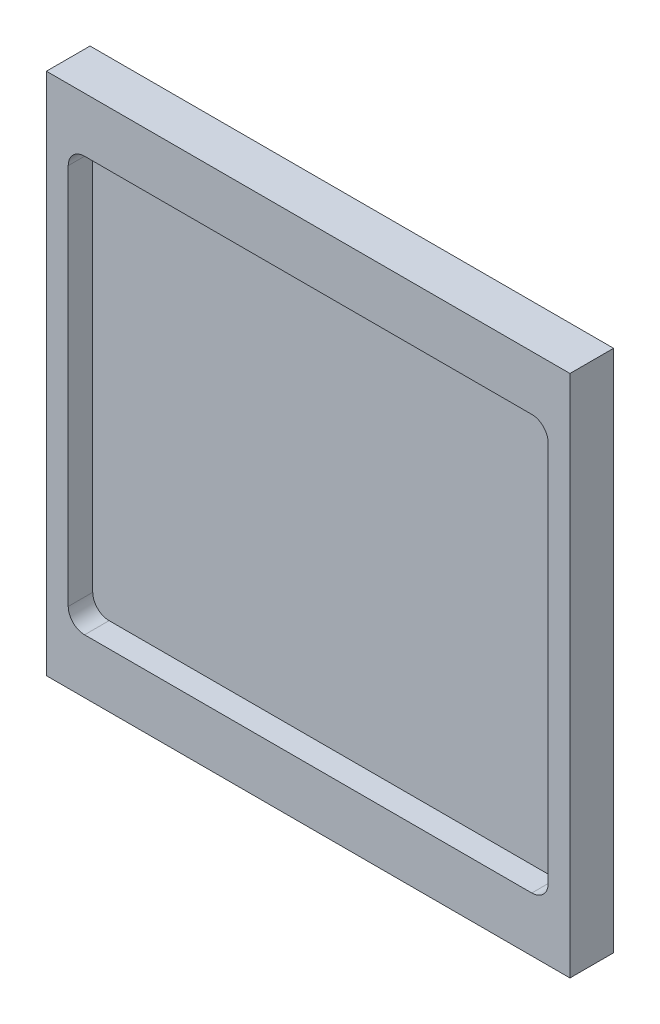
ISO-10303-21;
HEADER;
FILE_DESCRIPTION(('STEP AP214'),'2;1');
FILE_NAME('part.step','',(''),(''),'','','');
FILE_SCHEMA(('AUTOMOTIVE_DESIGN { 1 0 10303 214 1 1 1 1 }'));
ENDSEC;
DATA;
#1=APPLICATION_CONTEXT('core data for automotive mechanical design processes');
#2=APPLICATION_PROTOCOL_DEFINITION('international standard','automotive_design',2000,#1);
#3=PRODUCT_CONTEXT('',#1,'mechanical');
#4=PRODUCT('Part','Part','',(#3));
#5=PRODUCT_RELATED_PRODUCT_CATEGORY('part','',(#4));
#6=PRODUCT_DEFINITION_FORMATION('','',#4);
#7=PRODUCT_DEFINITION_CONTEXT('part definition',#1,'design');
#8=PRODUCT_DEFINITION('design','',#6,#7);
#9=PRODUCT_DEFINITION_SHAPE('','',#8);
#10=(LENGTH_UNIT() NAMED_UNIT(*) SI_UNIT(.MILLI.,.METRE.));
#11=(NAMED_UNIT(*) PLANE_ANGLE_UNIT() SI_UNIT($,.RADIAN.));
#12=(NAMED_UNIT(*) SI_UNIT($,.STERADIAN.) SOLID_ANGLE_UNIT());
#13=UNCERTAINTY_MEASURE_WITH_UNIT(LENGTH_MEASURE(1.E-05),#10,'distance_accuracy_value','');
#14=(GEOMETRIC_REPRESENTATION_CONTEXT(3) GLOBAL_UNCERTAINTY_ASSIGNED_CONTEXT((#13)) GLOBAL_UNIT_ASSIGNED_CONTEXT((#10,
#11,#12)) REPRESENTATION_CONTEXT('',''));
#15=CARTESIAN_POINT('',(0.,0.,0.));
#16=DIRECTION('',(0.,0.,1.));
#17=DIRECTION('',(1.,0.,0.));
#18=AXIS2_PLACEMENT_3D('',#15,#16,#17);
#19=CARTESIAN_POINT('',(76.2,76.2,12.7));
#20=DIRECTION('',(-1.,0.,0.));
#21=DIRECTION('',(0.,0.,1.));
#22=AXIS2_PLACEMENT_3D('',#19,#20,#21);
#23=PLANE('',#22);
#24=DIRECTION('',(0.,1.,0.));
#25=VECTOR('',#24,1.);
#26=CARTESIAN_POINT('',(76.2,76.2,0.));
#27=LINE('',#26,#25);
#28=CARTESIAN_POINT('',(76.2,-76.2,0.));
#29=VERTEX_POINT('',#28);
#30=CARTESIAN_POINT('',(76.2,76.2,0.));
#31=VERTEX_POINT('',#30);
#32=EDGE_CURVE('E189',#29,#31,#27,.T.);
#33=ORIENTED_EDGE('',*,*,#32,.T.);
#34=DIRECTION('',(0.,0.,-1.));
#35=VECTOR('',#34,1.);
#36=CARTESIAN_POINT('',(76.2,76.2,12.7));
#37=LINE('',#36,#35);
#38=CARTESIAN_POINT('',(76.2,76.2,12.7));
#39=VERTEX_POINT('',#38);
#40=EDGE_CURVE('E11',#39,#31,#37,.T.);
#41=ORIENTED_EDGE('',*,*,#40,.F.);
#42=DIRECTION('',(0.,1.,0.));
#43=VECTOR('',#42,1.);
#44=CARTESIAN_POINT('',(76.2,76.2,12.7));
#45=LINE('',#44,#43);
#46=CARTESIAN_POINT('',(76.2,-76.2,12.7));
#47=VERTEX_POINT('',#46);
#48=EDGE_CURVE('E201',#47,#39,#45,.T.);
#49=ORIENTED_EDGE('',*,*,#48,.F.);
#50=DIRECTION('',(0.,0.,-1.));
#51=VECTOR('',#50,1.);
#52=CARTESIAN_POINT('',(76.2,-76.2,12.7));
#53=LINE('',#52,#51);
#54=EDGE_CURVE('E207',#47,#29,#53,.T.);
#55=ORIENTED_EDGE('',*,*,#54,.T.);
#56=EDGE_LOOP('',(#33,#41,#49,#55));
#57=FACE_BOUND('',#56,.T.);
#58=ADVANCED_FACE('F33',(#57),#23,.F.);
#59=CARTESIAN_POINT('',(-76.2,76.2,12.7));
#60=DIRECTION('',(0.,-1.,0.));
#61=DIRECTION('',(0.,0.,-1.));
#62=AXIS2_PLACEMENT_3D('',#59,#60,#61);
#63=PLANE('',#62);
#64=DIRECTION('',(-1.,0.,0.));
#65=VECTOR('',#64,1.);
#66=CARTESIAN_POINT('',(-76.2,76.2,0.));
#67=LINE('',#66,#65);
#68=CARTESIAN_POINT('',(-76.2,76.2,0.));
#69=VERTEX_POINT('',#68);
#70=EDGE_CURVE('E210',#31,#69,#67,.T.);
#71=ORIENTED_EDGE('',*,*,#70,.T.);
#72=DIRECTION('',(0.,0.,-1.));
#73=VECTOR('',#72,1.);
#74=CARTESIAN_POINT('',(-76.2,76.2,12.7));
#75=LINE('',#74,#73);
#76=CARTESIAN_POINT('',(-76.2,76.2,12.7));
#77=VERTEX_POINT('',#76);
#78=EDGE_CURVE('E40',#77,#69,#75,.T.);
#79=ORIENTED_EDGE('',*,*,#78,.F.);
#80=DIRECTION('',(-1.,0.,0.));
#81=VECTOR('',#80,1.);
#82=CARTESIAN_POINT('',(-76.2,76.2,12.7));
#83=LINE('',#82,#81);
#84=EDGE_CURVE('E84',#39,#77,#83,.T.);
#85=ORIENTED_EDGE('',*,*,#84,.F.);
#86=ORIENTED_EDGE('',*,*,#40,.T.);
#87=EDGE_LOOP('',(#71,#79,#85,#86));
#88=FACE_BOUND('',#87,.T.);
#89=ADVANCED_FACE('F239',(#88),#63,.F.);
#90=CARTESIAN_POINT('',(-76.2,76.2,12.7));
#91=DIRECTION('',(1.,0.,0.));
#92=DIRECTION('',(0.,1.,0.));
#93=AXIS2_PLACEMENT_3D('',#90,#91,#92);
#94=PLANE('',#93);
#95=DIRECTION('',(0.,-1.,0.));
#96=VECTOR('',#95,1.);
#97=CARTESIAN_POINT('',(-76.2,76.2,0.));
#98=LINE('',#97,#96);
#99=CARTESIAN_POINT('',(-76.2,-76.2,0.));
#100=VERTEX_POINT('',#99);
#101=EDGE_CURVE('E212',#69,#100,#98,.T.);
#102=ORIENTED_EDGE('',*,*,#101,.T.);
#103=DIRECTION('',(0.,0.,-1.));
#104=VECTOR('',#103,1.);
#105=CARTESIAN_POINT('',(-76.2,-76.2,12.7));
#106=LINE('',#105,#104);
#107=CARTESIAN_POINT('',(-76.2,-76.2,12.7));
#108=VERTEX_POINT('',#107);
#109=EDGE_CURVE('E216',#108,#100,#106,.T.);
#110=ORIENTED_EDGE('',*,*,#109,.F.);
#111=DIRECTION('',(0.,-1.,0.));
#112=VECTOR('',#111,1.);
#113=CARTESIAN_POINT('',(-76.2,76.2,12.7));
#114=LINE('',#113,#112);
#115=EDGE_CURVE('E204',#77,#108,#114,.T.);
#116=ORIENTED_EDGE('',*,*,#115,.F.);
#117=ORIENTED_EDGE('',*,*,#78,.T.);
#118=EDGE_LOOP('',(#102,#110,#116,#117));
#119=FACE_BOUND('',#118,.T.);
#120=ADVANCED_FACE('F221',(#119),#94,.F.);
#121=CARTESIAN_POINT('',(-76.2,-76.2,12.7));
#122=DIRECTION('',(0.,1.,0.));
#123=DIRECTION('',(0.,0.,1.));
#124=AXIS2_PLACEMENT_3D('',#121,#122,#123);
#125=PLANE('',#124);
#126=DIRECTION('',(1.,0.,0.));
#127=VECTOR('',#126,1.);
#128=CARTESIAN_POINT('',(-76.2,-76.2,0.));
#129=LINE('',#128,#127);
#130=EDGE_CURVE('E77',#100,#29,#129,.T.);
#131=ORIENTED_EDGE('',*,*,#130,.T.);
#132=ORIENTED_EDGE('',*,*,#54,.F.);
#133=DIRECTION('',(1.,0.,0.));
#134=VECTOR('',#133,1.);
#135=CARTESIAN_POINT('',(-76.2,-76.2,12.7));
#136=LINE('',#135,#134);
#137=EDGE_CURVE('E56',#108,#47,#136,.T.);
#138=ORIENTED_EDGE('',*,*,#137,.F.);
#139=ORIENTED_EDGE('',*,*,#109,.T.);
#140=EDGE_LOOP('',(#131,#132,#138,#139));
#141=FACE_BOUND('',#140,.T.);
#142=ADVANCED_FACE('F229',(#141),#125,.F.);
#143=CARTESIAN_POINT('',(0.,0.,12.7));
#144=DIRECTION('',(0.,0.,1.));
#145=DIRECTION('',(1.,0.,0.));
#146=AXIS2_PLACEMENT_3D('',#143,#144,#145);
#147=PLANE('',#146);
#148=CARTESIAN_POINT('',(-65.0875,-55.5625,12.7));
#149=DIRECTION('',(0.,0.,1.));
#150=DIRECTION('',(1.,0.,0.));
#151=AXIS2_PLACEMENT_3D('',#148,#149,#150);
#152=CIRCLE('',#151,4.7625);
#153=CARTESIAN_POINT('',(-69.85,-55.5625,12.7));
#154=VERTEX_POINT('',#153);
#155=CARTESIAN_POINT('',(-65.0874999999999,-60.325,12.7));
#156=VERTEX_POINT('',#155);
#157=EDGE_CURVE('E47',#154,#156,#152,.T.);
#158=ORIENTED_EDGE('',*,*,#157,.F.);
#159=DIRECTION('',(0.,-1.,0.));
#160=VECTOR('',#159,1.);
#161=CARTESIAN_POINT('',(-69.85,55.5625,12.7));
#162=LINE('',#161,#160);
#163=CARTESIAN_POINT('',(-69.85,55.5625,12.7));
#164=VERTEX_POINT('',#163);
#165=EDGE_CURVE('E151',#164,#154,#162,.T.);
#166=ORIENTED_EDGE('',*,*,#165,.F.);
#167=CARTESIAN_POINT('',(-65.0875,55.5625,12.7));
#168=DIRECTION('',(0.,0.,1.));
#169=DIRECTION('',(1.,0.,0.));
#170=AXIS2_PLACEMENT_3D('',#167,#168,#169);
#171=CIRCLE('',#170,4.7625);
#172=CARTESIAN_POINT('',(-65.0874999999999,60.325,12.7));
#173=VERTEX_POINT('',#172);
#174=EDGE_CURVE('E154',#173,#164,#171,.T.);
#175=ORIENTED_EDGE('',*,*,#174,.F.);
#176=DIRECTION('',(-1.,0.,0.));
#177=VECTOR('',#176,1.);
#178=CARTESIAN_POINT('',(-65.0874999999999,60.325,12.7));
#179=LINE('',#178,#177);
#180=CARTESIAN_POINT('',(65.0874999999999,60.325,12.7));
#181=VERTEX_POINT('',#180);
#182=EDGE_CURVE('E182',#181,#173,#179,.T.);
#183=ORIENTED_EDGE('',*,*,#182,.F.);
#184=CARTESIAN_POINT('',(65.0875,55.5625,12.7));
#185=DIRECTION('',(0.,0.,1.));
#186=DIRECTION('',(-1.,0.,0.));
#187=AXIS2_PLACEMENT_3D('',#184,#185,#186);
#188=CIRCLE('',#187,4.7625);
#189=CARTESIAN_POINT('',(69.85,55.5625,12.7));
#190=VERTEX_POINT('',#189);
#191=EDGE_CURVE('E179',#190,#181,#188,.T.);
#192=ORIENTED_EDGE('',*,*,#191,.F.);
#193=DIRECTION('',(0.,1.,0.));
#194=VECTOR('',#193,1.);
#195=CARTESIAN_POINT('',(69.85,55.5625,12.7));
#196=LINE('',#195,#194);
#197=CARTESIAN_POINT('',(69.85,-55.5625,12.7));
#198=VERTEX_POINT('',#197);
#199=EDGE_CURVE('E176',#198,#190,#196,.T.);
#200=ORIENTED_EDGE('',*,*,#199,.F.);
#201=CARTESIAN_POINT('',(65.0875,-55.5625,12.7));
#202=DIRECTION('',(0.,0.,1.));
#203=DIRECTION('',(1.,0.,0.));
#204=AXIS2_PLACEMENT_3D('',#201,#202,#203);
#205=CIRCLE('',#204,4.7625);
#206=CARTESIAN_POINT('',(65.0874999999999,-60.325,12.7));
#207=VERTEX_POINT('',#206);
#208=EDGE_CURVE('E173',#207,#198,#205,.T.);
#209=ORIENTED_EDGE('',*,*,#208,.F.);
#210=DIRECTION('',(1.,0.,0.));
#211=VECTOR('',#210,1.);
#212=CARTESIAN_POINT('',(-65.0874999999999,-60.325,12.7));
#213=LINE('',#212,#211);
#214=EDGE_CURVE('E171',#156,#207,#213,.T.);
#215=ORIENTED_EDGE('',*,*,#214,.F.);
#216=EDGE_LOOP('',(#158,#166,#175,#183,#192,#200,#209,#215));
#217=FACE_BOUND('',#216,.T.);
#218=ORIENTED_EDGE('',*,*,#48,.T.);
#219=ORIENTED_EDGE('',*,*,#84,.T.);
#220=ORIENTED_EDGE('',*,*,#115,.T.);
#221=ORIENTED_EDGE('',*,*,#137,.T.);
#222=EDGE_LOOP('',(#218,#219,#220,#221));
#223=FACE_BOUND('',#222,.T.);
#224=ADVANCED_FACE('F231',(#217,#223),#147,.T.);
#225=CARTESIAN_POINT('',(0.,0.,0.));
#226=DIRECTION('',(0.,0.,1.));
#227=DIRECTION('',(1.,0.,0.));
#228=AXIS2_PLACEMENT_3D('',#225,#226,#227);
#229=PLANE('',#228);
#230=ORIENTED_EDGE('',*,*,#32,.F.);
#231=ORIENTED_EDGE('',*,*,#130,.F.);
#232=ORIENTED_EDGE('',*,*,#101,.F.);
#233=ORIENTED_EDGE('',*,*,#70,.F.);
#234=EDGE_LOOP('',(#230,#231,#232,#233));
#235=FACE_BOUND('',#234,.T.);
#236=ADVANCED_FACE('F225',(#235),#229,.F.);
#237=CARTESIAN_POINT('',(-65.0875,-55.5625,5.5626));
#238=DIRECTION('',(0.,0.,1.));
#239=DIRECTION('',(1.,0.,0.));
#240=AXIS2_PLACEMENT_3D('',#237,#238,#239);
#241=CYLINDRICAL_SURFACE('',#240,4.7625);
#242=ORIENTED_EDGE('',*,*,#157,.T.);
#243=DIRECTION('',(0.,0.,1.));
#244=VECTOR('',#243,1.);
#245=CARTESIAN_POINT('',(-65.0874999999999,-60.325,5.5626));
#246=LINE('',#245,#244);
#247=CARTESIAN_POINT('',(-65.0874999999999,-60.325,5.5626));
#248=VERTEX_POINT('',#247);
#249=EDGE_CURVE('E128',#248,#156,#246,.T.);
#250=ORIENTED_EDGE('',*,*,#249,.F.);
#251=CARTESIAN_POINT('',(-65.0875,-55.5625,5.5626));
#252=DIRECTION('',(0.,0.,1.));
#253=DIRECTION('',(1.,0.,0.));
#254=AXIS2_PLACEMENT_3D('',#251,#252,#253);
#255=CIRCLE('',#254,4.7625);
#256=CARTESIAN_POINT('',(-69.85,-55.5625,5.5626));
#257=VERTEX_POINT('',#256);
#258=EDGE_CURVE('E132',#257,#248,#255,.T.);
#259=ORIENTED_EDGE('',*,*,#258,.F.);
#260=DIRECTION('',(0.,0.,1.));
#261=VECTOR('',#260,1.);
#262=CARTESIAN_POINT('',(-69.85,-55.5625,5.5626));
#263=LINE('',#262,#261);
#264=EDGE_CURVE('E187',#257,#154,#263,.T.);
#265=ORIENTED_EDGE('',*,*,#264,.T.);
#266=EDGE_LOOP('',(#242,#250,#259,#265));
#267=FACE_BOUND('',#266,.T.);
#268=ADVANCED_FACE('F130',(#267),#241,.F.);
#269=CARTESIAN_POINT('',(-69.85,55.5625,5.5626));
#270=DIRECTION('',(-1.,0.,0.));
#271=DIRECTION('',(0.,0.,1.));
#272=AXIS2_PLACEMENT_3D('',#269,#270,#271);
#273=PLANE('',#272);
#274=ORIENTED_EDGE('',*,*,#165,.T.);
#275=ORIENTED_EDGE('',*,*,#264,.F.);
#276=DIRECTION('',(0.,-1.,0.));
#277=VECTOR('',#276,1.);
#278=CARTESIAN_POINT('',(-69.85,55.5625,5.5626));
#279=LINE('',#278,#277);
#280=CARTESIAN_POINT('',(-69.85,55.5625,5.5626));
#281=VERTEX_POINT('',#280);
#282=EDGE_CURVE('E138',#281,#257,#279,.T.);
#283=ORIENTED_EDGE('',*,*,#282,.F.);
#284=DIRECTION('',(0.,0.,1.));
#285=VECTOR('',#284,1.);
#286=CARTESIAN_POINT('',(-69.85,55.5625,5.5626));
#287=LINE('',#286,#285);
#288=EDGE_CURVE('E190',#281,#164,#287,.T.);
#289=ORIENTED_EDGE('',*,*,#288,.T.);
#290=EDGE_LOOP('',(#274,#275,#283,#289));
#291=FACE_BOUND('',#290,.T.);
#292=ADVANCED_FACE('F278',(#291),#273,.F.);
#293=CARTESIAN_POINT('',(-65.0875,55.5625,5.5626));
#294=DIRECTION('',(0.,0.,1.));
#295=DIRECTION('',(1.,0.,0.));
#296=AXIS2_PLACEMENT_3D('',#293,#294,#295);
#297=CYLINDRICAL_SURFACE('',#296,4.7625);
#298=ORIENTED_EDGE('',*,*,#174,.T.);
#299=ORIENTED_EDGE('',*,*,#288,.F.);
#300=CARTESIAN_POINT('',(-65.0875,55.5625,5.5626));
#301=DIRECTION('',(0.,0.,1.));
#302=DIRECTION('',(1.,0.,0.));
#303=AXIS2_PLACEMENT_3D('',#300,#301,#302);
#304=CIRCLE('',#303,4.7625);
#305=CARTESIAN_POINT('',(-65.0874999999999,60.325,5.5626));
#306=VERTEX_POINT('',#305);
#307=EDGE_CURVE('E167',#306,#281,#304,.T.);
#308=ORIENTED_EDGE('',*,*,#307,.F.);
#309=DIRECTION('',(0.,0.,1.));
#310=VECTOR('',#309,1.);
#311=CARTESIAN_POINT('',(-65.0874999999999,60.325,5.5626));
#312=LINE('',#311,#310);
#313=EDGE_CURVE('E192',#306,#173,#312,.T.);
#314=ORIENTED_EDGE('',*,*,#313,.T.);
#315=EDGE_LOOP('',(#298,#299,#308,#314));
#316=FACE_BOUND('',#315,.T.);
#317=ADVANCED_FACE('F287',(#316),#297,.F.);
#318=CARTESIAN_POINT('',(-65.0874999999999,60.325,5.5626));
#319=DIRECTION('',(0.,1.,0.));
#320=DIRECTION('',(0.,0.,1.));
#321=AXIS2_PLACEMENT_3D('',#318,#319,#320);
#322=PLANE('',#321);
#323=ORIENTED_EDGE('',*,*,#182,.T.);
#324=ORIENTED_EDGE('',*,*,#313,.F.);
#325=DIRECTION('',(-1.,0.,0.));
#326=VECTOR('',#325,1.);
#327=CARTESIAN_POINT('',(-65.0874999999999,60.325,5.5626));
#328=LINE('',#327,#326);
#329=CARTESIAN_POINT('',(65.0874999999999,60.325,5.5626));
#330=VERTEX_POINT('',#329);
#331=EDGE_CURVE('E164',#330,#306,#328,.T.);
#332=ORIENTED_EDGE('',*,*,#331,.F.);
#333=DIRECTION('',(0.,0.,1.));
#334=VECTOR('',#333,1.);
#335=CARTESIAN_POINT('',(65.0874999999999,60.325,5.5626));
#336=LINE('',#335,#334);
#337=EDGE_CURVE('E194',#330,#181,#336,.T.);
#338=ORIENTED_EDGE('',*,*,#337,.T.);
#339=EDGE_LOOP('',(#323,#324,#332,#338));
#340=FACE_BOUND('',#339,.T.);
#341=ADVANCED_FACE('F297',(#340),#322,.F.);
#342=CARTESIAN_POINT('',(65.0875,55.5625,5.5626));
#343=DIRECTION('',(0.,0.,1.));
#344=DIRECTION('',(1.,0.,0.));
#345=AXIS2_PLACEMENT_3D('',#342,#343,#344);
#346=CYLINDRICAL_SURFACE('',#345,4.7625);
#347=ORIENTED_EDGE('',*,*,#191,.T.);
#348=ORIENTED_EDGE('',*,*,#337,.F.);
#349=CARTESIAN_POINT('',(65.0875,55.5625,5.5626));
#350=DIRECTION('',(0.,0.,1.));
#351=DIRECTION('',(-1.,0.,0.));
#352=AXIS2_PLACEMENT_3D('',#349,#350,#351);
#353=CIRCLE('',#352,4.7625);
#354=CARTESIAN_POINT('',(69.85,55.5625,5.5626));
#355=VERTEX_POINT('',#354);
#356=EDGE_CURVE('E161',#355,#330,#353,.T.);
#357=ORIENTED_EDGE('',*,*,#356,.F.);
#358=DIRECTION('',(0.,0.,1.));
#359=VECTOR('',#358,1.);
#360=CARTESIAN_POINT('',(69.85,55.5625,5.5626));
#361=LINE('',#360,#359);
#362=EDGE_CURVE('E196',#355,#190,#361,.T.);
#363=ORIENTED_EDGE('',*,*,#362,.T.);
#364=EDGE_LOOP('',(#347,#348,#357,#363));
#365=FACE_BOUND('',#364,.T.);
#366=ADVANCED_FACE('F307',(#365),#346,.F.);
#367=CARTESIAN_POINT('',(69.85,55.5625,5.5626));
#368=DIRECTION('',(1.,0.,0.));
#369=DIRECTION('',(0.,0.,-1.));
#370=AXIS2_PLACEMENT_3D('',#367,#368,#369);
#371=PLANE('',#370);
#372=ORIENTED_EDGE('',*,*,#199,.T.);
#373=ORIENTED_EDGE('',*,*,#362,.F.);
#374=DIRECTION('',(0.,1.,0.));
#375=VECTOR('',#374,1.);
#376=CARTESIAN_POINT('',(69.85,55.5625,5.5626));
#377=LINE('',#376,#375);
#378=CARTESIAN_POINT('',(69.85,-55.5625,5.5626));
#379=VERTEX_POINT('',#378);
#380=EDGE_CURVE('E158',#379,#355,#377,.T.);
#381=ORIENTED_EDGE('',*,*,#380,.F.);
#382=DIRECTION('',(0.,0.,1.));
#383=VECTOR('',#382,1.);
#384=CARTESIAN_POINT('',(69.85,-55.5625,5.5626));
#385=LINE('',#384,#383);
#386=EDGE_CURVE('E198',#379,#198,#385,.T.);
#387=ORIENTED_EDGE('',*,*,#386,.T.);
#388=EDGE_LOOP('',(#372,#373,#381,#387));
#389=FACE_BOUND('',#388,.T.);
#390=ADVANCED_FACE('F317',(#389),#371,.F.);
#391=CARTESIAN_POINT('',(65.0875,-55.5625,5.5626));
#392=DIRECTION('',(0.,0.,1.));
#393=DIRECTION('',(1.,0.,0.));
#394=AXIS2_PLACEMENT_3D('',#391,#392,#393);
#395=CYLINDRICAL_SURFACE('',#394,4.7625);
#396=ORIENTED_EDGE('',*,*,#208,.T.);
#397=ORIENTED_EDGE('',*,*,#386,.F.);
#398=CARTESIAN_POINT('',(65.0875,-55.5625,5.5626));
#399=DIRECTION('',(0.,0.,1.));
#400=DIRECTION('',(1.,0.,0.));
#401=AXIS2_PLACEMENT_3D('',#398,#399,#400);
#402=CIRCLE('',#401,4.7625);
#403=CARTESIAN_POINT('',(65.0874999999999,-60.325,5.5626));
#404=VERTEX_POINT('',#403);
#405=EDGE_CURVE('E146',#404,#379,#402,.T.);
#406=ORIENTED_EDGE('',*,*,#405,.F.);
#407=DIRECTION('',(0.,0.,1.));
#408=VECTOR('',#407,1.);
#409=CARTESIAN_POINT('',(65.0874999999999,-60.325,5.5626));
#410=LINE('',#409,#408);
#411=EDGE_CURVE('E137',#404,#207,#410,.T.);
#412=ORIENTED_EDGE('',*,*,#411,.T.);
#413=EDGE_LOOP('',(#396,#397,#406,#412));
#414=FACE_BOUND('',#413,.T.);
#415=ADVANCED_FACE('F327',(#414),#395,.F.);
#416=CARTESIAN_POINT('',(-65.0874999999999,-60.325,5.5626));
#417=DIRECTION('',(0.,-1.,0.));
#418=DIRECTION('',(0.,0.,-1.));
#419=AXIS2_PLACEMENT_3D('',#416,#417,#418);
#420=PLANE('',#419);
#421=ORIENTED_EDGE('',*,*,#214,.T.);
#422=ORIENTED_EDGE('',*,*,#411,.F.);
#423=DIRECTION('',(1.,0.,0.));
#424=VECTOR('',#423,1.);
#425=CARTESIAN_POINT('',(-65.0874999999999,-60.325,5.5626));
#426=LINE('',#425,#424);
#427=EDGE_CURVE('E141',#248,#404,#426,.T.);
#428=ORIENTED_EDGE('',*,*,#427,.F.);
#429=ORIENTED_EDGE('',*,*,#249,.T.);
#430=EDGE_LOOP('',(#421,#422,#428,#429));
#431=FACE_BOUND('',#430,.T.);
#432=ADVANCED_FACE('F142',(#431),#420,.F.);
#433=CARTESIAN_POINT('',(-65.0875,-55.5625,5.5626));
#434=DIRECTION('',(0.,0.,1.));
#435=DIRECTION('',(1.,0.,0.));
#436=AXIS2_PLACEMENT_3D('',#433,#434,#435);
#437=PLANE('',#436);
#438=ORIENTED_EDGE('',*,*,#258,.T.);
#439=ORIENTED_EDGE('',*,*,#427,.T.);
#440=ORIENTED_EDGE('',*,*,#405,.T.);
#441=ORIENTED_EDGE('',*,*,#380,.T.);
#442=ORIENTED_EDGE('',*,*,#356,.T.);
#443=ORIENTED_EDGE('',*,*,#331,.T.);
#444=ORIENTED_EDGE('',*,*,#307,.T.);
#445=ORIENTED_EDGE('',*,*,#282,.T.);
#446=EDGE_LOOP('',(#438,#439,#440,#441,#442,#443,#444,#445));
#447=FACE_BOUND('',#446,.T.);
#448=ADVANCED_FACE('F148',(#447),#437,.T.);
#449=CLOSED_SHELL('',(#58,#89,#120,#142,#224,#236,#268,#292,#317,#341,#366,#390,#415,#432,#448));
#450=MANIFOLD_SOLID_BREP('B2',#449);
#451=ADVANCED_BREP_SHAPE_REPRESENTATION('',(#18,#450),#14);
#452=SHAPE_DEFINITION_REPRESENTATION(#9,#451);
ENDSEC;
END-ISO-10303-21;
